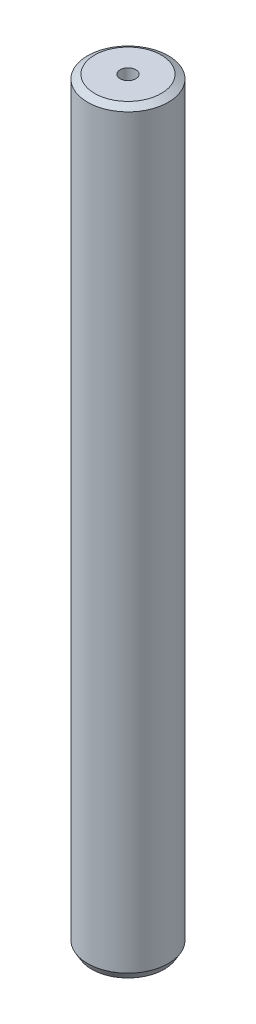
ISO-10303-21;
HEADER;
FILE_DESCRIPTION(('STEP AP214'),'2;1');
FILE_NAME('part.step','',(''),(''),'','','');
FILE_SCHEMA(('AUTOMOTIVE_DESIGN { 1 0 10303 214 1 1 1 1 }'));
ENDSEC;
DATA;
#1=APPLICATION_CONTEXT('core data for automotive mechanical design processes');
#2=APPLICATION_PROTOCOL_DEFINITION('international standard','automotive_design',2000,#1);
#3=PRODUCT_CONTEXT('',#1,'mechanical');
#4=PRODUCT('Part','Part','',(#3));
#5=PRODUCT_RELATED_PRODUCT_CATEGORY('part','',(#4));
#6=PRODUCT_DEFINITION_FORMATION('','',#4);
#7=PRODUCT_DEFINITION_CONTEXT('part definition',#1,'design');
#8=PRODUCT_DEFINITION('design','',#6,#7);
#9=PRODUCT_DEFINITION_SHAPE('','',#8);
#10=(LENGTH_UNIT() NAMED_UNIT(*) SI_UNIT(.MILLI.,.METRE.));
#11=(NAMED_UNIT(*) PLANE_ANGLE_UNIT() SI_UNIT($,.RADIAN.));
#12=(NAMED_UNIT(*) SI_UNIT($,.STERADIAN.) SOLID_ANGLE_UNIT());
#13=UNCERTAINTY_MEASURE_WITH_UNIT(LENGTH_MEASURE(1.E-05),#10,'distance_accuracy_value','');
#14=(GEOMETRIC_REPRESENTATION_CONTEXT(3) GLOBAL_UNCERTAINTY_ASSIGNED_CONTEXT((#13)) GLOBAL_UNIT_ASSIGNED_CONTEXT((#10,
#11,#12)) REPRESENTATION_CONTEXT('',''));
#15=CARTESIAN_POINT('',(0.,0.,0.));
#16=DIRECTION('',(0.,0.,1.));
#17=DIRECTION('',(1.,0.,0.));
#18=AXIS2_PLACEMENT_3D('',#15,#16,#17);
#19=CARTESIAN_POINT('',(0.,93.781609254727,0.));
#20=DIRECTION('',(0.,-1.,0.));
#21=DIRECTION('',(0.,0.,-1.));
#22=AXIS2_PLACEMENT_3D('',#19,#20,#21);
#23=CYLINDRICAL_SURFACE('',#22,5.);
#24=CARTESIAN_POINT('',(0.,93.2766817317878,0.));
#25=DIRECTION('',(0.,1.,0.));
#26=DIRECTION('',(0.,0.,1.));
#27=AXIS2_PLACEMENT_3D('',#24,#25,#26);
#28=CIRCLE('',#27,5.);
#29=CARTESIAN_POINT('',(0.,93.2766817317878,5.));
#30=VERTEX_POINT('',#29);
#31=EDGE_CURVE('E50',#30,#30,#28,.F.);
#32=ORIENTED_EDGE('',*,*,#31,.T.);
#33=EDGE_LOOP('',(#32));
#34=FACE_BOUND('',#33,.T.);
#35=CARTESIAN_POINT('',(0.,0.874560123870605,0.));
#36=DIRECTION('',(0.,1.,0.));
#37=DIRECTION('',(0.,0.,1.));
#38=AXIS2_PLACEMENT_3D('',#35,#36,#37);
#39=CIRCLE('',#38,5.);
#40=CARTESIAN_POINT('',(0.,0.874560123870605,5.));
#41=VERTEX_POINT('',#40);
#42=EDGE_CURVE('E51',#41,#41,#39,.T.);
#43=ORIENTED_EDGE('',*,*,#42,.T.);
#44=EDGE_LOOP('',(#43));
#45=FACE_BOUND('',#44,.T.);
#46=ADVANCED_FACE('F39',(#34,#45),#23,.T.);
#47=CARTESIAN_POINT('',(0.,93.781609254727,0.));
#48=DIRECTION('',(0.,1.,0.));
#49=DIRECTION('',(0.,0.,1.));
#50=AXIS2_PLACEMENT_3D('',#47,#48,#49);
#51=PLANE('',#50);
#52=CARTESIAN_POINT('',(0.,93.781609254727,0.));
#53=DIRECTION('',(0.,1.,0.));
#54=DIRECTION('',(0.,0.,1.));
#55=AXIS2_PLACEMENT_3D('',#52,#53,#54);
#56=CIRCLE('',#55,4.12543987612939);
#57=CARTESIAN_POINT('',(0.,93.781609254727,4.12543987612939));
#58=VERTEX_POINT('',#57);
#59=EDGE_CURVE('E54',#58,#58,#56,.T.);
#60=ORIENTED_EDGE('',*,*,#59,.T.);
#61=EDGE_LOOP('',(#60));
#62=FACE_BOUND('',#61,.T.);
#63=CARTESIAN_POINT('',(0.,93.781609254727,0.));
#64=DIRECTION('',(0.,1.,0.));
#65=DIRECTION('',(0.,0.,1.));
#66=AXIS2_PLACEMENT_3D('',#63,#64,#65);
#67=CIRCLE('',#66,0.971554325858547);
#68=CARTESIAN_POINT('',(0.,93.781609254727,0.971554325858547));
#69=VERTEX_POINT('',#68);
#70=EDGE_CURVE('E58',#69,#69,#67,.T.);
#71=ORIENTED_EDGE('',*,*,#70,.F.);
#72=EDGE_LOOP('',(#71));
#73=FACE_BOUND('',#72,.T.);
#74=ADVANCED_FACE('F69',(#62,#73),#51,.T.);
#75=CARTESIAN_POINT('',(0.,0.,0.));
#76=DIRECTION('',(0.,1.,0.));
#77=DIRECTION('',(0.,0.,1.));
#78=AXIS2_PLACEMENT_3D('',#75,#76,#77);
#79=PLANE('',#78);
#80=CARTESIAN_POINT('',(0.,0.,0.));
#81=DIRECTION('',(0.,1.,0.));
#82=DIRECTION('',(0.,0.,1.));
#83=AXIS2_PLACEMENT_3D('',#80,#81,#82);
#84=CIRCLE('',#83,4.49507247706079);
#85=CARTESIAN_POINT('',(0.,0.,4.49507247706079));
#86=VERTEX_POINT('',#85);
#87=EDGE_CURVE('E10',#86,#86,#84,.F.);
#88=ORIENTED_EDGE('',*,*,#87,.T.);
#89=EDGE_LOOP('',(#88));
#90=FACE_BOUND('',#89,.T.);
#91=CARTESIAN_POINT('',(0.,0.,0.));
#92=DIRECTION('',(0.,1.,0.));
#93=DIRECTION('',(0.,0.,1.));
#94=AXIS2_PLACEMENT_3D('',#91,#92,#93);
#95=CIRCLE('',#94,0.971554325858547);
#96=CARTESIAN_POINT('',(0.,0.,0.971554325858547));
#97=VERTEX_POINT('',#96);
#98=EDGE_CURVE('E63',#97,#97,#95,.T.);
#99=ORIENTED_EDGE('',*,*,#98,.T.);
#100=EDGE_LOOP('',(#99));
#101=FACE_BOUND('',#100,.T.);
#102=ADVANCED_FACE('F75',(#90,#101),#79,.F.);
#103=CARTESIAN_POINT('',(0.,93.781609254727,0.));
#104=DIRECTION('',(0.,-1.,0.));
#105=DIRECTION('',(0.,0.,-1.));
#106=AXIS2_PLACEMENT_3D('',#103,#104,#105);
#107=CYLINDRICAL_SURFACE('',#106,0.971554325858547);
#108=ORIENTED_EDGE('',*,*,#70,.T.);
#109=EDGE_LOOP('',(#108));
#110=FACE_BOUND('',#109,.T.);
#111=ORIENTED_EDGE('',*,*,#98,.F.);
#112=EDGE_LOOP('',(#111));
#113=FACE_BOUND('',#112,.T.);
#114=ADVANCED_FACE('F70',(#110,#113),#107,.F.);
#115=CARTESIAN_POINT('',(0.,93.781609254727,0.));
#116=DIRECTION('',(0.,-1.,0.));
#117=DIRECTION('',(0.,0.,-1.));
#118=AXIS2_PLACEMENT_3D('',#115,#116,#117);
#119=CONICAL_SURFACE('',#118,4.12543987612939,1.0471975511966);
#120=ORIENTED_EDGE('',*,*,#31,.F.);
#121=EDGE_LOOP('',(#120));
#122=FACE_BOUND('',#121,.T.);
#123=ORIENTED_EDGE('',*,*,#59,.F.);
#124=EDGE_LOOP('',(#123));
#125=FACE_BOUND('',#124,.T.);
#126=ADVANCED_FACE('F81',(#122,#125),#119,.T.);
#127=CARTESIAN_POINT('',(0.,0.874560123870605,0.));
#128=DIRECTION('',(0.,1.,0.));
#129=DIRECTION('',(0.,0.,1.));
#130=AXIS2_PLACEMENT_3D('',#127,#128,#129);
#131=CONICAL_SURFACE('',#130,5.,0.523598775598303);
#132=CARTESIAN_POINT('',(0.,0.,4.49507247706079));
#133=CARTESIAN_POINT('',(0.,0.00911000129031868,4.50033213875807));
#134=CARTESIAN_POINT('',(0.,0.0182200025806375,4.50559180045536));
#135=CARTESIAN_POINT('',(0.,0.0364400051612751,4.51611112384992));
#136=CARTESIAN_POINT('',(0.,0.0455500064515939,4.52137078554721));
#137=CARTESIAN_POINT('',(0.,0.0637700090322315,4.53189010894177));
#138=CARTESIAN_POINT('',(0.,0.0728800103225503,4.53714977063906));
#139=CARTESIAN_POINT('',(0.,0.0911000129031879,4.54766909403362));
#140=CARTESIAN_POINT('',(0.,0.100210014193507,4.55292875573091));
#141=CARTESIAN_POINT('',(0.,0.118430016774144,4.56344807912547));
#142=CARTESIAN_POINT('',(0.,0.127540018064463,4.56870774082276));
#143=CARTESIAN_POINT('',(0.,0.145760020645101,4.57922706421732));
#144=CARTESIAN_POINT('',(0.,0.15487002193542,4.58448672591461));
#145=CARTESIAN_POINT('',(0.,0.173090024516057,4.59500604930917));
#146=CARTESIAN_POINT('',(0.,0.182200025806376,4.60026571100646));
#147=CARTESIAN_POINT('',(0.,0.200420028387013,4.61078503440103));
#148=CARTESIAN_POINT('',(0.,0.209530029677332,4.61604469609831));
#149=CARTESIAN_POINT('',(0.,0.22775003225797,4.62656401949288));
#150=CARTESIAN_POINT('',(0.,0.236860033548289,4.63182368119016));
#151=CARTESIAN_POINT('',(0.,0.255080036128926,4.64234300458473));
#152=CARTESIAN_POINT('',(0.,0.264190037419245,4.64760266628201));
#153=CARTESIAN_POINT('',(0.,0.282410039999883,4.65812198967658));
#154=CARTESIAN_POINT('',(0.,0.291520041290201,4.66338165137386));
#155=CARTESIAN_POINT('',(0.,0.309740043870839,4.67390097476843));
#156=CARTESIAN_POINT('',(0.,0.318850045161158,4.67916063646571));
#157=CARTESIAN_POINT('',(0.,0.337070047741796,4.68967995986028));
#158=CARTESIAN_POINT('',(0.,0.346180049032114,4.69493962155756));
#159=CARTESIAN_POINT('',(0.,0.364400051612752,4.70545894495213));
#160=CARTESIAN_POINT('',(0.,0.373510052903071,4.71071860664941));
#161=CARTESIAN_POINT('',(0.,0.391730055483708,4.72123793004398));
#162=CARTESIAN_POINT('',(0.,0.400840056774027,4.72649759174126));
#163=CARTESIAN_POINT('',(0.,0.419060059354665,4.73701691513583));
#164=CARTESIAN_POINT('',(0.,0.428170060644983,4.74227657683311));
#165=CARTESIAN_POINT('',(0.,0.446390063225621,4.75279590022768));
#166=CARTESIAN_POINT('',(0.,0.45550006451594,4.75805556192496));
#167=CARTESIAN_POINT('',(0.,0.473720067096578,4.76857488531953));
#168=CARTESIAN_POINT('',(0.,0.482830068386896,4.77383454701681));
#169=CARTESIAN_POINT('',(0.,0.501050070967534,4.78435387041138));
#170=CARTESIAN_POINT('',(0.,0.510160072257853,4.78961353210866));
#171=CARTESIAN_POINT('',(0.,0.52838007483849,4.80013285550323));
#172=CARTESIAN_POINT('',(0.,0.537490076128809,4.80539251720051));
#173=CARTESIAN_POINT('',(0.,0.555710078709447,4.81591184059508));
#174=CARTESIAN_POINT('',(0.,0.564820079999766,4.82117150229236));
#175=CARTESIAN_POINT('',(0.,0.583040082580403,4.83169082568693));
#176=CARTESIAN_POINT('',(0.,0.592150083870722,4.83695048738421));
#177=CARTESIAN_POINT('',(0.,0.610370086451359,4.84746981077878));
#178=CARTESIAN_POINT('',(0.,0.619480087741678,4.85272947247606));
#179=CARTESIAN_POINT('',(0.,0.637700090322316,4.86324879587063));
#180=CARTESIAN_POINT('',(0.,0.646810091612635,4.86850845756791));
#181=CARTESIAN_POINT('',(0.,0.665030094193272,4.87902778096248));
#182=CARTESIAN_POINT('',(0.,0.674140095483591,4.88428744265976));
#183=CARTESIAN_POINT('',(0.,0.692360098064229,4.89480676605433));
#184=CARTESIAN_POINT('',(0.,0.701470099354548,4.90006642775161));
#185=CARTESIAN_POINT('',(0.,0.719690101935185,4.91058575114618));
#186=CARTESIAN_POINT('',(0.,0.728800103225504,4.91584541284347));
#187=CARTESIAN_POINT('',(0.,0.747020105806141,4.92636473623803));
#188=CARTESIAN_POINT('',(0.,0.75613010709646,4.93162439793532));
#189=CARTESIAN_POINT('',(0.,0.774350109677098,4.94214372132988));
#190=CARTESIAN_POINT('',(0.,0.783460110967417,4.94740338302717));
#191=CARTESIAN_POINT('',(0.,0.801680113548054,4.95792270642173));
#192=CARTESIAN_POINT('',(0.,0.810790114838373,4.96318236811902));
#193=CARTESIAN_POINT('',(0.,0.829010117419011,4.97370169151358));
#194=CARTESIAN_POINT('',(0.,0.838120118709329,4.97896135321087));
#195=CARTESIAN_POINT('',(0.,0.856340121289967,4.98948067660543));
#196=CARTESIAN_POINT('',(0.,0.865450122580286,4.99474033830272));
#197=CARTESIAN_POINT('',(0.,0.874560123870605,5.));
#198=B_SPLINE_CURVE_WITH_KNOTS('',3,(#132,#133,#134,#135,#136,#137,#138,#139,#140,#141,#142,
#143,#144,#145,#146,#147,#148,#149,#150,#151,#152,#153,#154,#155,#156,#157,#158,#159,#160,#161,
#162,#163,#164,#165,#166,#167,#168,#169,#170,#171,#172,#173,#174,#175,#176,#177,#178,#179,#180,
#181,#182,#183,#184,#185,#186,#187,#188,#189,#190,#191,#192,#193,#194,#195,#196,#197),
.UNSPECIFIED.,.F.,.F.,(4,2,2,2,2,2,2,2,2,2,2,2,2,2,2,2,2,2,2,2,2,2,2,2,2,2,2,2,2,2,2,2,4),(0.,
0.0315579701837004,0.0631159403674008,0.0946739105511012,0.126231880734802,0.157789850918502,
0.189347821102202,0.220905791285903,0.252463761469604,0.284021731653304,0.315579701837004,
0.347137672020705,0.378695642204405,0.410253612388106,0.441811582571806,0.473369552755506,
0.504927522939207,0.536485493122907,0.568043463306608,0.599601433490309,0.631159403674009,
0.662717373857709,0.69427534404141,0.72583331422511,0.757391284408811,0.788949254592511,
0.820507224776211,0.852065194959912,0.883623165143613,0.915181135327313,0.946739105511013,
0.978297075694714,1.00985504587841),.UNSPECIFIED.);
#199=EDGE_CURVE('BSEAM45',#86,#41,#198,.T.);
#200=ORIENTED_EDGE('',*,*,#87,.F.);
#201=ORIENTED_EDGE('',*,*,#42,.F.);
#202=ORIENTED_EDGE('',*,*,#199,.T.);
#203=ORIENTED_EDGE('',*,*,#199,.F.);
#204=EDGE_LOOP('',(#200,#202,#201,#203));
#205=FACE_BOUND('',#204,.T.);
#206=ADVANCED_FACE('F45',(#205),#131,.T.);
#207=CLOSED_SHELL('',(#46,#74,#102,#114,#126,#206));
#208=MANIFOLD_SOLID_BREP('B2',#207);
#209=ADVANCED_BREP_SHAPE_REPRESENTATION('',(#18,#208),#14);
#210=SHAPE_DEFINITION_REPRESENTATION(#9,#209);
ENDSEC;
END-ISO-10303-21;
